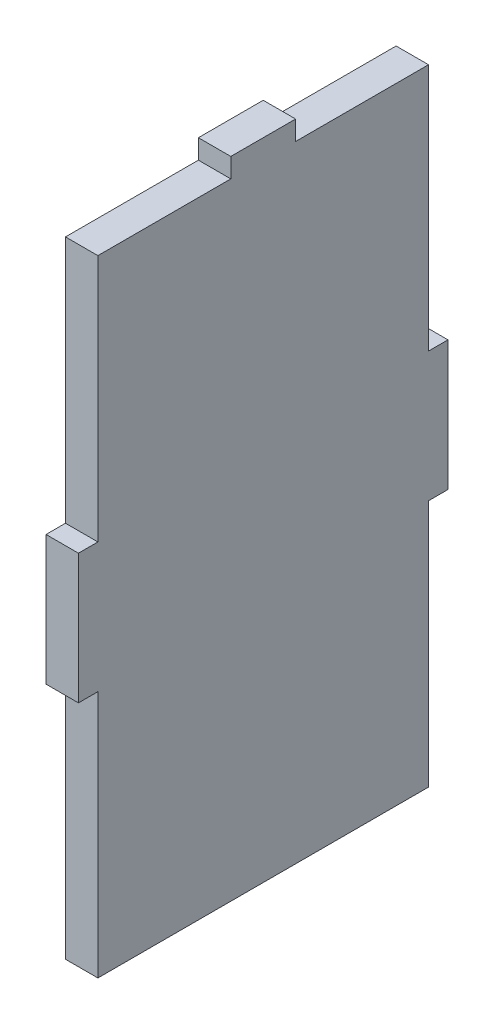
ISO-10303-21;
HEADER;
FILE_DESCRIPTION(('STEP AP214'),'2;1');
FILE_NAME('part.step','',(''),(''),'','','');
FILE_SCHEMA(('AUTOMOTIVE_DESIGN { 1 0 10303 214 1 1 1 1 }'));
ENDSEC;
DATA;
#1=APPLICATION_CONTEXT('core data for automotive mechanical design processes');
#2=APPLICATION_PROTOCOL_DEFINITION('international standard','automotive_design',2000,#1);
#3=PRODUCT_CONTEXT('',#1,'mechanical');
#4=PRODUCT('Part','Part','',(#3));
#5=PRODUCT_RELATED_PRODUCT_CATEGORY('part','',(#4));
#6=PRODUCT_DEFINITION_FORMATION('','',#4);
#7=PRODUCT_DEFINITION_CONTEXT('part definition',#1,'design');
#8=PRODUCT_DEFINITION('design','',#6,#7);
#9=PRODUCT_DEFINITION_SHAPE('','',#8);
#10=(LENGTH_UNIT() NAMED_UNIT(*) SI_UNIT(.MILLI.,.METRE.));
#11=(NAMED_UNIT(*) PLANE_ANGLE_UNIT() SI_UNIT($,.RADIAN.));
#12=(NAMED_UNIT(*) SI_UNIT($,.STERADIAN.) SOLID_ANGLE_UNIT());
#13=UNCERTAINTY_MEASURE_WITH_UNIT(LENGTH_MEASURE(1.E-05),#10,'distance_accuracy_value','');
#14=(GEOMETRIC_REPRESENTATION_CONTEXT(3) GLOBAL_UNCERTAINTY_ASSIGNED_CONTEXT((#13)) GLOBAL_UNIT_ASSIGNED_CONTEXT((#10,
#11,#12)) REPRESENTATION_CONTEXT('',''));
#15=CARTESIAN_POINT('',(0.,0.,0.));
#16=DIRECTION('',(0.,0.,1.));
#17=DIRECTION('',(1.,0.,0.));
#18=AXIS2_PLACEMENT_3D('',#15,#16,#17);
#19=CARTESIAN_POINT('',(4.99999820052148,-57.7500017024481,2.));
#20=DIRECTION('',(0.,0.,1.));
#21=DIRECTION('',(0.,1.,0.));
#22=AXIS2_PLACEMENT_3D('',#19,#20,#21);
#23=PLANE('',#22);
#24=DIRECTION('',(1.,0.,0.));
#25=VECTOR('',#24,1.);
#26=CARTESIAN_POINT('',(4.99999820052148,-57.7500017024481,2.));
#27=LINE('',#26,#25);
#28=CARTESIAN_POINT('',(7.68865509937298E-13,-57.750001702448,1.99999999999999));
#29=VERTEX_POINT('',#28);
#30=CARTESIAN_POINT('',(4.99999820052148,-57.7500017024481,2.));
#31=VERTEX_POINT('',#30);
#32=EDGE_CURVE('E11',#29,#31,#27,.T.);
#33=ORIENTED_EDGE('',*,*,#32,.F.);
#34=DIRECTION('',(0.,-1.,0.));
#35=VECTOR('',#34,1.);
#36=CARTESIAN_POINT('',(0.,0.,1.99999999999999));
#37=LINE('',#36,#35);
#38=CARTESIAN_POINT('',(5.02591748111693E-13,-37.750001702448,1.99999999999999));
#39=VERTEX_POINT('',#38);
#40=EDGE_CURVE('E136',#29,#39,#37,.F.);
#41=ORIENTED_EDGE('',*,*,#40,.T.);
#42=DIRECTION('',(1.,0.,0.));
#43=VECTOR('',#42,1.);
#44=CARTESIAN_POINT('',(4.9999982005212,-37.7500017024481,2.));
#45=LINE('',#44,#43);
#46=CARTESIAN_POINT('',(4.9999982005212,-37.7500017024481,2.));
#47=VERTEX_POINT('',#46);
#48=EDGE_CURVE('E55',#39,#47,#45,.T.);
#49=ORIENTED_EDGE('',*,*,#48,.T.);
#50=DIRECTION('',(0.,1.,0.));
#51=VECTOR('',#50,1.);
#52=CARTESIAN_POINT('',(4.99999820052148,-57.7500017024481,2.));
#53=LINE('',#52,#51);
#54=EDGE_CURVE('E240',#31,#47,#53,.T.);
#55=ORIENTED_EDGE('',*,*,#54,.F.);
#56=EDGE_LOOP('',(#33,#41,#49,#55));
#57=FACE_BOUND('',#56,.T.);
#58=ADVANCED_FACE('F45',(#57),#23,.F.);
#59=CARTESIAN_POINT('',(4.9999982005212,-37.7500017024481,2.));
#60=DIRECTION('',(0.,-1.,0.));
#61=DIRECTION('',(0.,0.,1.));
#62=AXIS2_PLACEMENT_3D('',#59,#60,#61);
#63=PLANE('',#62);
#64=ORIENTED_EDGE('',*,*,#48,.F.);
#65=DIRECTION('',(0.,0.,1.));
#66=VECTOR('',#65,1.);
#67=CARTESIAN_POINT('',(5.02591748111693E-13,-37.750001702448,56.));
#68=LINE('',#67,#66);
#69=CARTESIAN_POINT('',(5.02591748111693E-13,-37.750001702448,5.));
#70=VERTEX_POINT('',#69);
#71=EDGE_CURVE('E194',#39,#70,#68,.T.);
#72=ORIENTED_EDGE('',*,*,#71,.T.);
#73=DIRECTION('',(1.,0.,0.));
#74=VECTOR('',#73,1.);
#75=CARTESIAN_POINT('',(4.9999982005212,-37.7500017024481,5.));
#76=LINE('',#75,#74);
#77=CARTESIAN_POINT('',(4.9999982005212,-37.7500017024481,5.));
#78=VERTEX_POINT('',#77);
#79=EDGE_CURVE('E233',#70,#78,#76,.T.);
#80=ORIENTED_EDGE('',*,*,#79,.T.);
#81=DIRECTION('',(0.,0.,1.));
#82=VECTOR('',#81,1.);
#83=CARTESIAN_POINT('',(4.9999982005212,-37.7500017024481,2.));
#84=LINE('',#83,#82);
#85=EDGE_CURVE('E249',#47,#78,#84,.T.);
#86=ORIENTED_EDGE('',*,*,#85,.F.);
#87=EDGE_LOOP('',(#64,#72,#80,#86));
#88=FACE_BOUND('',#87,.T.);
#89=ADVANCED_FACE('F253',(#88),#63,.F.);
#90=CARTESIAN_POINT('',(4.99999999999997,0.,5.));
#91=DIRECTION('',(0.,0.,1.));
#92=DIRECTION('',(0.,1.,0.));
#93=AXIS2_PLACEMENT_3D('',#90,#91,#92);
#94=PLANE('',#93);
#95=ORIENTED_EDGE('',*,*,#79,.F.);
#96=DIRECTION('',(0.,-1.,0.));
#97=VECTOR('',#96,1.);
#98=CARTESIAN_POINT('',(0.,0.,5.));
#99=LINE('',#98,#97);
#100=CARTESIAN_POINT('',(0.,0.500000000000002,5.));
#101=VERTEX_POINT('',#100);
#102=EDGE_CURVE('E190',#70,#101,#99,.F.);
#103=ORIENTED_EDGE('',*,*,#102,.T.);
#104=DIRECTION('',(1.,0.,0.));
#105=VECTOR('',#104,1.);
#106=CARTESIAN_POINT('',(4.99999999999997,0.499999999999935,5.));
#107=LINE('',#106,#105);
#108=CARTESIAN_POINT('',(4.99999999999997,0.499999999999935,5.));
#109=VERTEX_POINT('',#108);
#110=EDGE_CURVE('E230',#101,#109,#107,.T.);
#111=ORIENTED_EDGE('',*,*,#110,.T.);
#112=DIRECTION('',(0.,1.,0.));
#113=VECTOR('',#112,1.);
#114=CARTESIAN_POINT('',(4.99999999999997,0.,5.));
#115=LINE('',#114,#113);
#116=EDGE_CURVE('E255',#78,#109,#115,.T.);
#117=ORIENTED_EDGE('',*,*,#116,.F.);
#118=EDGE_LOOP('',(#95,#103,#111,#117));
#119=FACE_BOUND('',#118,.T.);
#120=ADVANCED_FACE('F344',(#119),#94,.F.);
#121=CARTESIAN_POINT('',(4.99999999999997,0.499999999999935,56.));
#122=DIRECTION('',(0.,1.,0.));
#123=DIRECTION('',(0.,0.,-1.));
#124=AXIS2_PLACEMENT_3D('',#121,#122,#123);
#125=PLANE('',#124);
#126=ORIENTED_EDGE('',*,*,#110,.F.);
#127=DIRECTION('',(0.,0.,1.));
#128=VECTOR('',#127,1.);
#129=CARTESIAN_POINT('',(0.,0.500000000000002,56.));
#130=LINE('',#129,#128);
#131=CARTESIAN_POINT('',(0.,0.500000000000002,25.5));
#132=VERTEX_POINT('',#131);
#133=EDGE_CURVE('E186',#132,#101,#130,.F.);
#134=ORIENTED_EDGE('',*,*,#133,.F.);
#135=DIRECTION('',(1.,0.,0.));
#136=VECTOR('',#135,1.);
#137=CARTESIAN_POINT('',(4.99999999999997,0.499999999999935,25.5));
#138=LINE('',#137,#136);
#139=CARTESIAN_POINT('',(4.99999999999997,0.499999999999935,25.5));
#140=VERTEX_POINT('',#139);
#141=EDGE_CURVE('E227',#132,#140,#138,.T.);
#142=ORIENTED_EDGE('',*,*,#141,.T.);
#143=DIRECTION('',(0.,0.,-1.));
#144=VECTOR('',#143,1.);
#145=CARTESIAN_POINT('',(4.99999999999997,0.499999999999935,56.));
#146=LINE('',#145,#144);
#147=EDGE_CURVE('E259',#140,#109,#146,.T.);
#148=ORIENTED_EDGE('',*,*,#147,.T.);
#149=EDGE_LOOP('',(#126,#134,#142,#148));
#150=FACE_BOUND('',#149,.T.);
#151=ADVANCED_FACE('F350',(#150),#125,.T.);
#152=CARTESIAN_POINT('',(4.99999999999993,3.49999999999993,25.5));
#153=DIRECTION('',(0.,0.,-1.));
#154=DIRECTION('',(0.,-1.,0.));
#155=AXIS2_PLACEMENT_3D('',#152,#153,#154);
#156=PLANE('',#155);
#157=ORIENTED_EDGE('',*,*,#141,.F.);
#158=DIRECTION('',(0.,-1.,0.));
#159=VECTOR('',#158,1.);
#160=CARTESIAN_POINT('',(0.,0.,25.5));
#161=LINE('',#160,#159);
#162=CARTESIAN_POINT('',(0.,3.49999999999999,25.5));
#163=VERTEX_POINT('',#162);
#164=EDGE_CURVE('E182',#163,#132,#161,.T.);
#165=ORIENTED_EDGE('',*,*,#164,.F.);
#166=DIRECTION('',(1.,0.,0.));
#167=VECTOR('',#166,1.);
#168=CARTESIAN_POINT('',(4.99999999999993,3.49999999999993,25.5));
#169=LINE('',#168,#167);
#170=CARTESIAN_POINT('',(4.99999999999993,3.49999999999993,25.5));
#171=VERTEX_POINT('',#170);
#172=EDGE_CURVE('E224',#163,#171,#169,.T.);
#173=ORIENTED_EDGE('',*,*,#172,.T.);
#174=DIRECTION('',(0.,-1.,0.));
#175=VECTOR('',#174,1.);
#176=CARTESIAN_POINT('',(4.99999999999993,3.49999999999993,25.5));
#177=LINE('',#176,#175);
#178=EDGE_CURVE('E266',#171,#140,#177,.T.);
#179=ORIENTED_EDGE('',*,*,#178,.T.);
#180=EDGE_LOOP('',(#157,#165,#173,#179));
#181=FACE_BOUND('',#180,.T.);
#182=ADVANCED_FACE('F353',(#181),#156,.T.);
#183=CARTESIAN_POINT('',(4.99999999999993,3.49999999999993,25.5));
#184=DIRECTION('',(0.,1.,0.));
#185=DIRECTION('',(0.,0.,-1.));
#186=AXIS2_PLACEMENT_3D('',#183,#184,#185);
#187=PLANE('',#186);
#188=ORIENTED_EDGE('',*,*,#172,.F.);
#189=DIRECTION('',(0.,0.,1.));
#190=VECTOR('',#189,1.);
#191=CARTESIAN_POINT('',(0.,3.49999999999999,56.));
#192=LINE('',#191,#190);
#193=CARTESIAN_POINT('',(0.,3.49999999999999,35.5));
#194=VERTEX_POINT('',#193);
#195=EDGE_CURVE('E178',#194,#163,#192,.F.);
#196=ORIENTED_EDGE('',*,*,#195,.F.);
#197=DIRECTION('',(1.,0.,0.));
#198=VECTOR('',#197,1.);
#199=CARTESIAN_POINT('',(4.99999999999993,3.49999999999993,35.5));
#200=LINE('',#199,#198);
#201=CARTESIAN_POINT('',(4.99999999999993,3.49999999999993,35.5));
#202=VERTEX_POINT('',#201);
#203=EDGE_CURVE('E221',#194,#202,#200,.T.);
#204=ORIENTED_EDGE('',*,*,#203,.T.);
#205=DIRECTION('',(0.,0.,-1.));
#206=VECTOR('',#205,1.);
#207=CARTESIAN_POINT('',(4.99999999999993,3.49999999999993,25.5));
#208=LINE('',#207,#206);
#209=EDGE_CURVE('E271',#202,#171,#208,.T.);
#210=ORIENTED_EDGE('',*,*,#209,.T.);
#211=EDGE_LOOP('',(#188,#196,#204,#210));
#212=FACE_BOUND('',#211,.T.);
#213=ADVANCED_FACE('F357',(#212),#187,.T.);
#214=CARTESIAN_POINT('',(4.99999999999993,3.49999999999993,35.5));
#215=DIRECTION('',(0.,0.,-1.));
#216=DIRECTION('',(0.,-1.,0.));
#217=AXIS2_PLACEMENT_3D('',#214,#215,#216);
#218=PLANE('',#217);
#219=ORIENTED_EDGE('',*,*,#203,.F.);
#220=DIRECTION('',(0.,-1.,0.));
#221=VECTOR('',#220,1.);
#222=CARTESIAN_POINT('',(0.,0.,35.5));
#223=LINE('',#222,#221);
#224=CARTESIAN_POINT('',(0.,0.500000000000002,35.5));
#225=VERTEX_POINT('',#224);
#226=EDGE_CURVE('E174',#194,#225,#223,.T.);
#227=ORIENTED_EDGE('',*,*,#226,.T.);
#228=DIRECTION('',(1.,0.,0.));
#229=VECTOR('',#228,1.);
#230=CARTESIAN_POINT('',(5.,0.499999999999935,35.5));
#231=LINE('',#230,#229);
#232=CARTESIAN_POINT('',(5.,0.499999999999935,35.5));
#233=VERTEX_POINT('',#232);
#234=EDGE_CURVE('E218',#225,#233,#231,.T.);
#235=ORIENTED_EDGE('',*,*,#234,.T.);
#236=DIRECTION('',(0.,-1.,0.));
#237=VECTOR('',#236,1.);
#238=CARTESIAN_POINT('',(4.99999999999993,3.49999999999993,35.5));
#239=LINE('',#238,#237);
#240=EDGE_CURVE('E275',#202,#233,#239,.T.);
#241=ORIENTED_EDGE('',*,*,#240,.F.);
#242=EDGE_LOOP('',(#219,#227,#235,#241));
#243=FACE_BOUND('',#242,.T.);
#244=ADVANCED_FACE('F362',(#243),#218,.F.);
#245=ORIENTED_EDGE('',*,*,#234,.F.);
#246=DIRECTION('',(0.,0.,1.));
#247=VECTOR('',#246,1.);
#248=CARTESIAN_POINT('',(0.,0.500000000000002,56.));
#249=LINE('',#248,#247);
#250=CARTESIAN_POINT('',(0.,0.500000000000002,56.));
#251=VERTEX_POINT('',#250);
#252=EDGE_CURVE('E170',#251,#225,#249,.F.);
#253=ORIENTED_EDGE('',*,*,#252,.F.);
#254=DIRECTION('',(1.,0.,0.));
#255=VECTOR('',#254,1.);
#256=CARTESIAN_POINT('',(4.99999999999997,0.499999999999935,56.));
#257=LINE('',#256,#255);
#258=CARTESIAN_POINT('',(4.99999999999997,0.499999999999935,56.));
#259=VERTEX_POINT('',#258);
#260=EDGE_CURVE('E215',#251,#259,#257,.T.);
#261=ORIENTED_EDGE('',*,*,#260,.T.);
#262=EDGE_CURVE('E267',#259,#233,#146,.T.);
#263=ORIENTED_EDGE('',*,*,#262,.T.);
#264=EDGE_LOOP('',(#245,#253,#261,#263));
#265=FACE_BOUND('',#264,.T.);
#266=ADVANCED_FACE('F365',(#265),#125,.T.);
#267=CARTESIAN_POINT('',(5.,0.,56.));
#268=DIRECTION('',(0.,0.,1.));
#269=DIRECTION('',(0.,1.,0.));
#270=AXIS2_PLACEMENT_3D('',#267,#268,#269);
#271=PLANE('',#270);
#272=ORIENTED_EDGE('',*,*,#260,.F.);
#273=DIRECTION('',(0.,-1.,0.));
#274=VECTOR('',#273,1.);
#275=CARTESIAN_POINT('',(0.,0.,56.));
#276=LINE('',#275,#274);
#277=CARTESIAN_POINT('',(5.02591748111693E-13,-37.750001702448,56.));
#278=VERTEX_POINT('',#277);
#279=EDGE_CURVE('E166',#278,#251,#276,.F.);
#280=ORIENTED_EDGE('',*,*,#279,.F.);
#281=DIRECTION('',(1.,0.,0.));
#282=VECTOR('',#281,1.);
#283=CARTESIAN_POINT('',(5.00000000000049,-37.7500017024481,56.));
#284=LINE('',#283,#282);
#285=CARTESIAN_POINT('',(5.00000000000049,-37.7500017024481,56.));
#286=VERTEX_POINT('',#285);
#287=EDGE_CURVE('E212',#278,#286,#284,.T.);
#288=ORIENTED_EDGE('',*,*,#287,.T.);
#289=DIRECTION('',(0.,1.,0.));
#290=VECTOR('',#289,1.);
#291=CARTESIAN_POINT('',(5.,0.,56.));
#292=LINE('',#291,#290);
#293=EDGE_CURVE('E279',#286,#259,#292,.T.);
#294=ORIENTED_EDGE('',*,*,#293,.T.);
#295=EDGE_LOOP('',(#272,#280,#288,#294));
#296=FACE_BOUND('',#295,.T.);
#297=ADVANCED_FACE('F366',(#296),#271,.T.);
#298=CARTESIAN_POINT('',(4.9999982005212,-37.7500017024481,59.));
#299=DIRECTION('',(0.,1.,0.));
#300=DIRECTION('',(0.,0.,-1.));
#301=AXIS2_PLACEMENT_3D('',#298,#299,#300);
#302=PLANE('',#301);
#303=ORIENTED_EDGE('',*,*,#287,.F.);
#304=DIRECTION('',(0.,0.,1.));
#305=VECTOR('',#304,1.);
#306=CARTESIAN_POINT('',(5.02591748111693E-13,-37.750001702448,56.));
#307=LINE('',#306,#305);
#308=CARTESIAN_POINT('',(5.02591748111693E-13,-37.750001702448,59.));
#309=VERTEX_POINT('',#308);
#310=EDGE_CURVE('E162',#309,#278,#307,.F.);
#311=ORIENTED_EDGE('',*,*,#310,.F.);
#312=DIRECTION('',(1.,0.,0.));
#313=VECTOR('',#312,1.);
#314=CARTESIAN_POINT('',(4.9999982005212,-37.7500017024481,59.));
#315=LINE('',#314,#313);
#316=CARTESIAN_POINT('',(4.9999982005212,-37.7500017024481,59.));
#317=VERTEX_POINT('',#316);
#318=EDGE_CURVE('E209',#309,#317,#315,.T.);
#319=ORIENTED_EDGE('',*,*,#318,.T.);
#320=DIRECTION('',(0.,0.,-1.));
#321=VECTOR('',#320,1.);
#322=CARTESIAN_POINT('',(4.9999982005212,-37.7500017024481,59.));
#323=LINE('',#322,#321);
#324=EDGE_CURVE('E283',#317,#286,#323,.T.);
#325=ORIENTED_EDGE('',*,*,#324,.T.);
#326=EDGE_LOOP('',(#303,#311,#319,#325));
#327=FACE_BOUND('',#326,.T.);
#328=ADVANCED_FACE('F323',(#327),#302,.T.);
#329=CARTESIAN_POINT('',(4.99999820052148,-57.7500017024481,59.));
#330=DIRECTION('',(0.,0.,1.));
#331=DIRECTION('',(0.,1.,0.));
#332=AXIS2_PLACEMENT_3D('',#329,#330,#331);
#333=PLANE('',#332);
#334=ORIENTED_EDGE('',*,*,#318,.F.);
#335=DIRECTION('',(0.,-1.,0.));
#336=VECTOR('',#335,1.);
#337=CARTESIAN_POINT('',(0.,0.,59.));
#338=LINE('',#337,#336);
#339=CARTESIAN_POINT('',(7.68865509937298E-13,-57.750001702448,59.));
#340=VERTEX_POINT('',#339);
#341=EDGE_CURVE('E158',#340,#309,#338,.F.);
#342=ORIENTED_EDGE('',*,*,#341,.F.);
#343=DIRECTION('',(1.,0.,0.));
#344=VECTOR('',#343,1.);
#345=CARTESIAN_POINT('',(4.99999820052148,-57.7500017024481,59.));
#346=LINE('',#345,#344);
#347=CARTESIAN_POINT('',(4.99999820052148,-57.7500017024481,59.));
#348=VERTEX_POINT('',#347);
#349=EDGE_CURVE('E206',#340,#348,#346,.T.);
#350=ORIENTED_EDGE('',*,*,#349,.T.);
#351=DIRECTION('',(0.,1.,0.));
#352=VECTOR('',#351,1.);
#353=CARTESIAN_POINT('',(4.99999820052148,-57.7500017024481,59.));
#354=LINE('',#353,#352);
#355=EDGE_CURVE('E288',#348,#317,#354,.T.);
#356=ORIENTED_EDGE('',*,*,#355,.T.);
#357=EDGE_LOOP('',(#334,#342,#350,#356));
#358=FACE_BOUND('',#357,.T.);
#359=ADVANCED_FACE('F314',(#358),#333,.T.);
#360=CARTESIAN_POINT('',(4.99999820052148,-57.7500017024481,59.));
#361=DIRECTION('',(0.,1.,0.));
#362=DIRECTION('',(0.,0.,-1.));
#363=AXIS2_PLACEMENT_3D('',#360,#361,#362);
#364=PLANE('',#363);
#365=ORIENTED_EDGE('',*,*,#349,.F.);
#366=DIRECTION('',(0.,0.,1.));
#367=VECTOR('',#366,1.);
#368=CARTESIAN_POINT('',(7.68865509937298E-13,-57.750001702448,56.));
#369=LINE('',#368,#367);
#370=CARTESIAN_POINT('',(7.68865509937298E-13,-57.750001702448,56.));
#371=VERTEX_POINT('',#370);
#372=EDGE_CURVE('E154',#340,#371,#369,.F.);
#373=ORIENTED_EDGE('',*,*,#372,.T.);
#374=DIRECTION('',(1.,0.,0.));
#375=VECTOR('',#374,1.);
#376=CARTESIAN_POINT('',(4.99999820052148,-57.7500017024481,56.));
#377=LINE('',#376,#375);
#378=CARTESIAN_POINT('',(4.99999820052148,-57.7500017024481,56.));
#379=VERTEX_POINT('',#378);
#380=EDGE_CURVE('E203',#371,#379,#377,.T.);
#381=ORIENTED_EDGE('',*,*,#380,.T.);
#382=DIRECTION('',(0.,0.,-1.));
#383=VECTOR('',#382,1.);
#384=CARTESIAN_POINT('',(4.99999820052148,-57.7500017024481,59.));
#385=LINE('',#384,#383);
#386=EDGE_CURVE('E291',#348,#379,#385,.T.);
#387=ORIENTED_EDGE('',*,*,#386,.F.);
#388=EDGE_LOOP('',(#365,#373,#381,#387));
#389=FACE_BOUND('',#388,.T.);
#390=ADVANCED_FACE('F311',(#389),#364,.F.);
#391=ORIENTED_EDGE('',*,*,#380,.F.);
#392=DIRECTION('',(0.,-1.,0.));
#393=VECTOR('',#392,1.);
#394=CARTESIAN_POINT('',(0.,0.,56.));
#395=LINE('',#394,#393);
#396=CARTESIAN_POINT('',(1.27811410209463E-12,-96.0000034048962,56.));
#397=VERTEX_POINT('',#396);
#398=EDGE_CURVE('E150',#397,#371,#395,.F.);
#399=ORIENTED_EDGE('',*,*,#398,.F.);
#400=DIRECTION('',(1.,0.,0.));
#401=VECTOR('',#400,1.);
#402=CARTESIAN_POINT('',(4.99999546013852,-96.0000034048962,56.));
#403=LINE('',#402,#401);
#404=CARTESIAN_POINT('',(4.99999546013852,-96.0000034048962,56.));
#405=VERTEX_POINT('',#404);
#406=EDGE_CURVE('E201',#397,#405,#403,.T.);
#407=ORIENTED_EDGE('',*,*,#406,.T.);
#408=EDGE_CURVE('E284',#405,#379,#292,.T.);
#409=ORIENTED_EDGE('',*,*,#408,.T.);
#410=EDGE_LOOP('',(#391,#399,#407,#409));
#411=FACE_BOUND('',#410,.T.);
#412=ADVANCED_FACE('F307',(#411),#271,.T.);
#413=CARTESIAN_POINT('',(4.99999546013852,-96.0000034048962,56.));
#414=DIRECTION('',(0.,1.,0.));
#415=DIRECTION('',(0.,0.,-1.));
#416=AXIS2_PLACEMENT_3D('',#413,#414,#415);
#417=PLANE('',#416);
#418=ORIENTED_EDGE('',*,*,#406,.F.);
#419=DIRECTION('',(0.,0.,1.));
#420=VECTOR('',#419,1.);
#421=CARTESIAN_POINT('',(1.27811410209463E-12,-96.0000034048962,56.));
#422=LINE('',#421,#420);
#423=CARTESIAN_POINT('',(1.27811410209463E-12,-96.0000034048962,5.));
#424=VERTEX_POINT('',#423);
#425=EDGE_CURVE('E146',#397,#424,#422,.F.);
#426=ORIENTED_EDGE('',*,*,#425,.T.);
#427=DIRECTION('',(1.,0.,0.));
#428=VECTOR('',#427,1.);
#429=CARTESIAN_POINT('',(4.99999546013852,-96.0000034048962,5.));
#430=LINE('',#429,#428);
#431=CARTESIAN_POINT('',(4.99999546013852,-96.0000034048962,5.));
#432=VERTEX_POINT('',#431);
#433=EDGE_CURVE('E63',#424,#432,#430,.T.);
#434=ORIENTED_EDGE('',*,*,#433,.T.);
#435=DIRECTION('',(0.,0.,-1.));
#436=VECTOR('',#435,1.);
#437=CARTESIAN_POINT('',(4.99999546013852,-96.0000034048962,56.));
#438=LINE('',#437,#436);
#439=EDGE_CURVE('E129',#405,#432,#438,.T.);
#440=ORIENTED_EDGE('',*,*,#439,.F.);
#441=EDGE_LOOP('',(#418,#426,#434,#440));
#442=FACE_BOUND('',#441,.T.);
#443=ADVANCED_FACE('F305',(#442),#417,.F.);
#444=ORIENTED_EDGE('',*,*,#433,.F.);
#445=DIRECTION('',(0.,-1.,0.));
#446=VECTOR('',#445,1.);
#447=CARTESIAN_POINT('',(0.,0.,5.));
#448=LINE('',#447,#446);
#449=CARTESIAN_POINT('',(7.68865509937298E-13,-57.750001702448,5.));
#450=VERTEX_POINT('',#449);
#451=EDGE_CURVE('E134',#424,#450,#448,.F.);
#452=ORIENTED_EDGE('',*,*,#451,.T.);
#453=DIRECTION('',(1.,0.,0.));
#454=VECTOR('',#453,1.);
#455=CARTESIAN_POINT('',(4.99999820052148,-57.7500017024481,5.));
#456=LINE('',#455,#454);
#457=CARTESIAN_POINT('',(4.99999820052148,-57.7500017024481,5.));
#458=VERTEX_POINT('',#457);
#459=EDGE_CURVE('E49',#450,#458,#456,.T.);
#460=ORIENTED_EDGE('',*,*,#459,.T.);
#461=EDGE_CURVE('E149',#432,#458,#115,.T.);
#462=ORIENTED_EDGE('',*,*,#461,.F.);
#463=EDGE_LOOP('',(#444,#452,#460,#462));
#464=FACE_BOUND('',#463,.T.);
#465=ADVANCED_FACE('F139',(#464),#94,.F.);
#466=CARTESIAN_POINT('',(4.99999820052148,-57.7500017024481,2.));
#467=DIRECTION('',(0.,-1.,0.));
#468=DIRECTION('',(0.,0.,1.));
#469=AXIS2_PLACEMENT_3D('',#466,#467,#468);
#470=PLANE('',#469);
#471=DIRECTION('',(0.,0.,1.));
#472=VECTOR('',#471,1.);
#473=CARTESIAN_POINT('',(7.68865509937298E-13,-57.750001702448,56.));
#474=LINE('',#473,#472);
#475=EDGE_CURVE('E123',#29,#450,#474,.T.);
#476=ORIENTED_EDGE('',*,*,#475,.F.);
#477=ORIENTED_EDGE('',*,*,#32,.T.);
#478=DIRECTION('',(0.,0.,1.));
#479=VECTOR('',#478,1.);
#480=CARTESIAN_POINT('',(4.99999820052148,-57.7500017024481,2.));
#481=LINE('',#480,#479);
#482=EDGE_CURVE('E125',#31,#458,#481,.T.);
#483=ORIENTED_EDGE('',*,*,#482,.T.);
#484=ORIENTED_EDGE('',*,*,#459,.F.);
#485=EDGE_LOOP('',(#476,#477,#483,#484));
#486=FACE_BOUND('',#485,.T.);
#487=ADVANCED_FACE('F47',(#486),#470,.T.);
#488=CARTESIAN_POINT('',(5.,0.,56.));
#489=DIRECTION('',(-1.,0.,0.));
#490=DIRECTION('',(0.,-1.,0.));
#491=AXIS2_PLACEMENT_3D('',#488,#489,#490);
#492=PLANE('',#491);
#493=ORIENTED_EDGE('',*,*,#461,.T.);
#494=ORIENTED_EDGE('',*,*,#482,.F.);
#495=ORIENTED_EDGE('',*,*,#54,.T.);
#496=ORIENTED_EDGE('',*,*,#85,.T.);
#497=ORIENTED_EDGE('',*,*,#116,.T.);
#498=ORIENTED_EDGE('',*,*,#147,.F.);
#499=ORIENTED_EDGE('',*,*,#178,.F.);
#500=ORIENTED_EDGE('',*,*,#209,.F.);
#501=ORIENTED_EDGE('',*,*,#240,.T.);
#502=ORIENTED_EDGE('',*,*,#262,.F.);
#503=ORIENTED_EDGE('',*,*,#293,.F.);
#504=ORIENTED_EDGE('',*,*,#324,.F.);
#505=ORIENTED_EDGE('',*,*,#355,.F.);
#506=ORIENTED_EDGE('',*,*,#386,.T.);
#507=ORIENTED_EDGE('',*,*,#408,.F.);
#508=ORIENTED_EDGE('',*,*,#439,.T.);
#509=EDGE_LOOP('',(#493,#494,#495,#496,#497,#498,#499,#500,#501,#502,#503,#504,#505,#506,#507,#508));
#510=FACE_BOUND('',#509,.T.);
#511=ADVANCED_FACE('F247',(#510),#492,.F.);
#512=CARTESIAN_POINT('',(0.,0.,56.));
#513=DIRECTION('',(-1.,0.,0.));
#514=DIRECTION('',(0.,-1.,0.));
#515=AXIS2_PLACEMENT_3D('',#512,#513,#514);
#516=PLANE('',#515);
#517=ORIENTED_EDGE('',*,*,#451,.F.);
#518=ORIENTED_EDGE('',*,*,#425,.F.);
#519=ORIENTED_EDGE('',*,*,#398,.T.);
#520=ORIENTED_EDGE('',*,*,#372,.F.);
#521=ORIENTED_EDGE('',*,*,#341,.T.);
#522=ORIENTED_EDGE('',*,*,#310,.T.);
#523=ORIENTED_EDGE('',*,*,#279,.T.);
#524=ORIENTED_EDGE('',*,*,#252,.T.);
#525=ORIENTED_EDGE('',*,*,#226,.F.);
#526=ORIENTED_EDGE('',*,*,#195,.T.);
#527=ORIENTED_EDGE('',*,*,#164,.T.);
#528=ORIENTED_EDGE('',*,*,#133,.T.);
#529=ORIENTED_EDGE('',*,*,#102,.F.);
#530=ORIENTED_EDGE('',*,*,#71,.F.);
#531=ORIENTED_EDGE('',*,*,#40,.F.);
#532=ORIENTED_EDGE('',*,*,#475,.T.);
#533=EDGE_LOOP('',(#517,#518,#519,#520,#521,#522,#523,#524,#525,#526,#527,#528,#529,#530,#531,#532));
#534=FACE_BOUND('',#533,.T.);
#535=ADVANCED_FACE('F132',(#534),#516,.T.);
#536=CLOSED_SHELL('',(#58,#89,#120,#151,#182,#213,#244,#266,#297,#328,#359,#390,#412,#443,#465,
#487,#511,#535));
#537=MANIFOLD_SOLID_BREP('B2',#536);
#538=ADVANCED_BREP_SHAPE_REPRESENTATION('',(#18,#537),#14);
#539=SHAPE_DEFINITION_REPRESENTATION(#9,#538);
ENDSEC;
END-ISO-10303-21;
